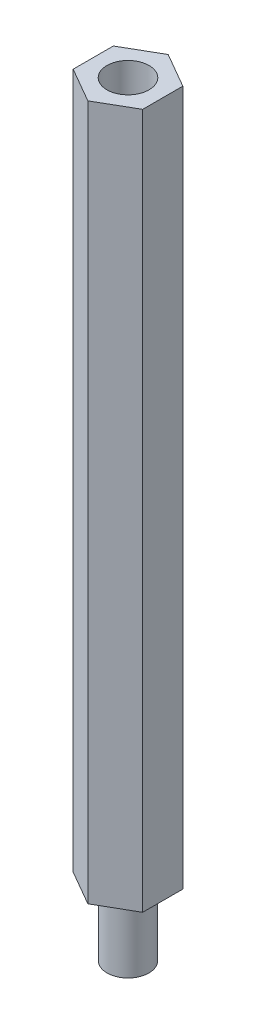
ISO-10303-21;
HEADER;
FILE_DESCRIPTION(('STEP AP214'),'2;1');
FILE_NAME('part.step','',(''),(''),'','','');
FILE_SCHEMA(('AUTOMOTIVE_DESIGN { 1 0 10303 214 1 1 1 1 }'));
ENDSEC;
DATA;
#1=APPLICATION_CONTEXT('core data for automotive mechanical design processes');
#2=APPLICATION_PROTOCOL_DEFINITION('international standard','automotive_design',2000,#1);
#3=PRODUCT_CONTEXT('',#1,'mechanical');
#4=PRODUCT('Part','Part','',(#3));
#5=PRODUCT_RELATED_PRODUCT_CATEGORY('part','',(#4));
#6=PRODUCT_DEFINITION_FORMATION('','',#4);
#7=PRODUCT_DEFINITION_CONTEXT('part definition',#1,'design');
#8=PRODUCT_DEFINITION('design','',#6,#7);
#9=PRODUCT_DEFINITION_SHAPE('','',#8);
#10=(LENGTH_UNIT() NAMED_UNIT(*) SI_UNIT(.MILLI.,.METRE.));
#11=(NAMED_UNIT(*) PLANE_ANGLE_UNIT() SI_UNIT($,.RADIAN.));
#12=(NAMED_UNIT(*) SI_UNIT($,.STERADIAN.) SOLID_ANGLE_UNIT());
#13=UNCERTAINTY_MEASURE_WITH_UNIT(LENGTH_MEASURE(1.E-05),#10,'distance_accuracy_value','');
#14=(GEOMETRIC_REPRESENTATION_CONTEXT(3) GLOBAL_UNCERTAINTY_ASSIGNED_CONTEXT((#13)) GLOBAL_UNIT_ASSIGNED_CONTEXT((#10,
#11,#12)) REPRESENTATION_CONTEXT('',''));
#15=CARTESIAN_POINT('',(0.,0.,0.));
#16=DIRECTION('',(0.,0.,1.));
#17=DIRECTION('',(1.,0.,0.));
#18=AXIS2_PLACEMENT_3D('',#15,#16,#17);
#19=CARTESIAN_POINT('',(-2.50000000000002,50.,1.44337567297408));
#20=DIRECTION('',(0.5,0.,-0.866025403784439));
#21=DIRECTION('',(-0.866025403784439,0.,-0.5));
#22=AXIS2_PLACEMENT_3D('',#19,#20,#21);
#23=PLANE('',#22);
#24=DIRECTION('',(0.866025403784439,0.,0.5));
#25=VECTOR('',#24,1.);
#26=CARTESIAN_POINT('',(-2.50000000000002,0.,1.44337567297408));
#27=LINE('',#26,#25);
#28=CARTESIAN_POINT('',(-2.50000000000002,0.,1.44337567297408));
#29=VERTEX_POINT('',#28);
#30=CARTESIAN_POINT('',(0.,0.,2.88675134594815));
#31=VERTEX_POINT('',#30);
#32=EDGE_CURVE('E122',#29,#31,#27,.T.);
#33=ORIENTED_EDGE('',*,*,#32,.T.);
#34=DIRECTION('',(0.,-1.,0.));
#35=VECTOR('',#34,1.);
#36=CARTESIAN_POINT('',(0.,50.,2.88675134594815));
#37=LINE('',#36,#35);
#38=CARTESIAN_POINT('',(0.,50.,2.88675134594815));
#39=VERTEX_POINT('',#38);
#40=EDGE_CURVE('E45',#39,#31,#37,.T.);
#41=ORIENTED_EDGE('',*,*,#40,.F.);
#42=DIRECTION('',(0.866025403784439,0.,0.5));
#43=VECTOR('',#42,1.);
#44=CARTESIAN_POINT('',(-2.50000000000002,50.,1.44337567297408));
#45=LINE('',#44,#43);
#46=CARTESIAN_POINT('',(-2.50000000000002,50.,1.44337567297408));
#47=VERTEX_POINT('',#46);
#48=EDGE_CURVE('E133',#47,#39,#45,.T.);
#49=ORIENTED_EDGE('',*,*,#48,.F.);
#50=DIRECTION('',(0.,-1.,0.));
#51=VECTOR('',#50,1.);
#52=CARTESIAN_POINT('',(-2.50000000000002,50.,1.44337567297408));
#53=LINE('',#52,#51);
#54=EDGE_CURVE('E118',#47,#29,#53,.T.);
#55=ORIENTED_EDGE('',*,*,#54,.T.);
#56=EDGE_LOOP('',(#33,#41,#49,#55));
#57=FACE_BOUND('',#56,.T.);
#58=ADVANCED_FACE('F37',(#57),#23,.F.);
#59=CARTESIAN_POINT('',(0.,50.,2.88675134594815));
#60=DIRECTION('',(-0.499999999999999,0.,-0.866025403784439));
#61=DIRECTION('',(-0.866025403784439,0.,0.499999999999999));
#62=AXIS2_PLACEMENT_3D('',#59,#60,#61);
#63=PLANE('',#62);
#64=DIRECTION('',(0.866025403784439,0.,-0.499999999999999));
#65=VECTOR('',#64,1.);
#66=CARTESIAN_POINT('',(0.,0.,2.88675134594815));
#67=LINE('',#66,#65);
#68=CARTESIAN_POINT('',(2.50000000000002,0.,1.44337567297408));
#69=VERTEX_POINT('',#68);
#70=EDGE_CURVE('E125',#31,#69,#67,.T.);
#71=ORIENTED_EDGE('',*,*,#70,.T.);
#72=DIRECTION('',(0.,-1.,0.));
#73=VECTOR('',#72,1.);
#74=CARTESIAN_POINT('',(2.50000000000002,50.,1.44337567297408));
#75=LINE('',#74,#73);
#76=CARTESIAN_POINT('',(2.50000000000002,50.,1.44337567297408));
#77=VERTEX_POINT('',#76);
#78=EDGE_CURVE('E137',#77,#69,#75,.T.);
#79=ORIENTED_EDGE('',*,*,#78,.F.);
#80=DIRECTION('',(0.866025403784439,0.,-0.499999999999999));
#81=VECTOR('',#80,1.);
#82=CARTESIAN_POINT('',(0.,50.,2.88675134594815));
#83=LINE('',#82,#81);
#84=EDGE_CURVE('E91',#39,#77,#83,.T.);
#85=ORIENTED_EDGE('',*,*,#84,.F.);
#86=ORIENTED_EDGE('',*,*,#40,.T.);
#87=EDGE_LOOP('',(#71,#79,#85,#86));
#88=FACE_BOUND('',#87,.T.);
#89=ADVANCED_FACE('F140',(#88),#63,.F.);
#90=CARTESIAN_POINT('',(2.50000000000002,50.,1.44337567297408));
#91=DIRECTION('',(-1.,0.,0.));
#92=DIRECTION('',(0.,0.,1.));
#93=AXIS2_PLACEMENT_3D('',#90,#91,#92);
#94=PLANE('',#93);
#95=DIRECTION('',(0.,0.,-1.));
#96=VECTOR('',#95,1.);
#97=CARTESIAN_POINT('',(2.50000000000002,0.,1.44337567297408));
#98=LINE('',#97,#96);
#99=CARTESIAN_POINT('',(2.50000000000002,0.,-1.44337567297408));
#100=VERTEX_POINT('',#99);
#101=EDGE_CURVE('E128',#69,#100,#98,.T.);
#102=ORIENTED_EDGE('',*,*,#101,.T.);
#103=DIRECTION('',(0.,-1.,0.));
#104=VECTOR('',#103,1.);
#105=CARTESIAN_POINT('',(2.50000000000002,50.,-1.44337567297408));
#106=LINE('',#105,#104);
#107=CARTESIAN_POINT('',(2.50000000000002,50.,-1.44337567297408));
#108=VERTEX_POINT('',#107);
#109=EDGE_CURVE('E113',#108,#100,#106,.T.);
#110=ORIENTED_EDGE('',*,*,#109,.F.);
#111=DIRECTION('',(0.,0.,-1.));
#112=VECTOR('',#111,1.);
#113=CARTESIAN_POINT('',(2.50000000000002,50.,1.44337567297408));
#114=LINE('',#113,#112);
#115=EDGE_CURVE('E104',#77,#108,#114,.T.);
#116=ORIENTED_EDGE('',*,*,#115,.F.);
#117=ORIENTED_EDGE('',*,*,#78,.T.);
#118=EDGE_LOOP('',(#102,#110,#116,#117));
#119=FACE_BOUND('',#118,.T.);
#120=ADVANCED_FACE('F148',(#119),#94,.F.);
#121=CARTESIAN_POINT('',(2.50000000000002,50.,-1.44337567297408));
#122=DIRECTION('',(-0.5,0.,0.866025403784439));
#123=DIRECTION('',(0.866025403784439,0.,0.5));
#124=AXIS2_PLACEMENT_3D('',#121,#122,#123);
#125=PLANE('',#124);
#126=DIRECTION('',(-0.866025403784439,0.,-0.5));
#127=VECTOR('',#126,1.);
#128=CARTESIAN_POINT('',(2.50000000000002,0.,-1.44337567297408));
#129=LINE('',#128,#127);
#130=CARTESIAN_POINT('',(0.,0.,-2.88675134594816));
#131=VERTEX_POINT('',#130);
#132=EDGE_CURVE('E112',#100,#131,#129,.T.);
#133=ORIENTED_EDGE('',*,*,#132,.T.);
#134=DIRECTION('',(0.,-1.,0.));
#135=VECTOR('',#134,1.);
#136=CARTESIAN_POINT('',(0.,50.,-2.88675134594816));
#137=LINE('',#136,#135);
#138=CARTESIAN_POINT('',(0.,50.,-2.88675134594816));
#139=VERTEX_POINT('',#138);
#140=EDGE_CURVE('E109',#139,#131,#137,.T.);
#141=ORIENTED_EDGE('',*,*,#140,.F.);
#142=DIRECTION('',(-0.866025403784439,0.,-0.5));
#143=VECTOR('',#142,1.);
#144=CARTESIAN_POINT('',(2.50000000000002,50.,-1.44337567297408));
#145=LINE('',#144,#143);
#146=EDGE_CURVE('E98',#108,#139,#145,.T.);
#147=ORIENTED_EDGE('',*,*,#146,.F.);
#148=ORIENTED_EDGE('',*,*,#109,.T.);
#149=EDGE_LOOP('',(#133,#141,#147,#148));
#150=FACE_BOUND('',#149,.T.);
#151=ADVANCED_FACE('F110',(#150),#125,.F.);
#152=CARTESIAN_POINT('',(0.,50.,-2.88675134594816));
#153=DIRECTION('',(0.5,0.,0.866025403784439));
#154=DIRECTION('',(0.866025403784439,0.,-0.5));
#155=AXIS2_PLACEMENT_3D('',#152,#153,#154);
#156=PLANE('',#155);
#157=DIRECTION('',(-0.866025403784439,0.,0.5));
#158=VECTOR('',#157,1.);
#159=CARTESIAN_POINT('',(0.,0.,-2.88675134594816));
#160=LINE('',#159,#158);
#161=CARTESIAN_POINT('',(-2.50000000000002,0.,-1.44337567297408));
#162=VERTEX_POINT('',#161);
#163=EDGE_CURVE('E76',#131,#162,#160,.T.);
#164=ORIENTED_EDGE('',*,*,#163,.T.);
#165=DIRECTION('',(0.,-1.,0.));
#166=VECTOR('',#165,1.);
#167=CARTESIAN_POINT('',(-2.50000000000002,50.,-1.44337567297408));
#168=LINE('',#167,#166);
#169=CARTESIAN_POINT('',(-2.50000000000002,50.,-1.44337567297408));
#170=VERTEX_POINT('',#169);
#171=EDGE_CURVE('E114',#170,#162,#168,.T.);
#172=ORIENTED_EDGE('',*,*,#171,.F.);
#173=DIRECTION('',(-0.866025403784439,0.,0.5));
#174=VECTOR('',#173,1.);
#175=CARTESIAN_POINT('',(0.,50.,-2.88675134594816));
#176=LINE('',#175,#174);
#177=EDGE_CURVE('E102',#139,#170,#176,.T.);
#178=ORIENTED_EDGE('',*,*,#177,.F.);
#179=ORIENTED_EDGE('',*,*,#140,.T.);
#180=EDGE_LOOP('',(#164,#172,#178,#179));
#181=FACE_BOUND('',#180,.T.);
#182=ADVANCED_FACE('F116',(#181),#156,.F.);
#183=CARTESIAN_POINT('',(-2.50000000000002,50.,-1.44337567297408));
#184=DIRECTION('',(1.,0.,0.));
#185=DIRECTION('',(0.,0.,-1.));
#186=AXIS2_PLACEMENT_3D('',#183,#184,#185);
#187=PLANE('',#186);
#188=DIRECTION('',(0.,0.,1.));
#189=VECTOR('',#188,1.);
#190=CARTESIAN_POINT('',(-2.50000000000002,0.,-1.44337567297408));
#191=LINE('',#190,#189);
#192=EDGE_CURVE('E82',#162,#29,#191,.T.);
#193=ORIENTED_EDGE('',*,*,#192,.T.);
#194=ORIENTED_EDGE('',*,*,#54,.F.);
#195=DIRECTION('',(0.,0.,1.));
#196=VECTOR('',#195,1.);
#197=CARTESIAN_POINT('',(-2.50000000000002,50.,-1.44337567297408));
#198=LINE('',#197,#196);
#199=EDGE_CURVE('E53',#170,#47,#198,.T.);
#200=ORIENTED_EDGE('',*,*,#199,.F.);
#201=ORIENTED_EDGE('',*,*,#171,.T.);
#202=EDGE_LOOP('',(#193,#194,#200,#201));
#203=FACE_BOUND('',#202,.T.);
#204=ADVANCED_FACE('F179',(#203),#187,.F.);
#205=CARTESIAN_POINT('',(0.,50.,0.));
#206=DIRECTION('',(0.,1.,0.));
#207=DIRECTION('',(0.,0.,1.));
#208=AXIS2_PLACEMENT_3D('',#205,#206,#207);
#209=PLANE('',#208);
#210=CARTESIAN_POINT('',(0.,50.,0.));
#211=DIRECTION('',(0.,1.,0.));
#212=DIRECTION('',(0.,0.,1.));
#213=AXIS2_PLACEMENT_3D('',#210,#211,#212);
#214=CIRCLE('',#213,1.51610249304691);
#215=CARTESIAN_POINT('',(0.,50.,1.51610249304691));
#216=VERTEX_POINT('',#215);
#217=EDGE_CURVE('E152',#216,#216,#214,.T.);
#218=ORIENTED_EDGE('',*,*,#217,.F.);
#219=EDGE_LOOP('',(#218));
#220=FACE_BOUND('',#219,.T.);
#221=ORIENTED_EDGE('',*,*,#48,.T.);
#222=ORIENTED_EDGE('',*,*,#84,.T.);
#223=ORIENTED_EDGE('',*,*,#115,.T.);
#224=ORIENTED_EDGE('',*,*,#146,.T.);
#225=ORIENTED_EDGE('',*,*,#177,.T.);
#226=ORIENTED_EDGE('',*,*,#199,.T.);
#227=EDGE_LOOP('',(#221,#222,#223,#224,#225,#226));
#228=FACE_BOUND('',#227,.T.);
#229=ADVANCED_FACE('F100',(#220,#228),#209,.T.);
#230=CARTESIAN_POINT('',(0.,0.,0.));
#231=DIRECTION('',(0.,1.,0.));
#232=DIRECTION('',(0.,0.,1.));
#233=AXIS2_PLACEMENT_3D('',#230,#231,#232);
#234=PLANE('',#233);
#235=CARTESIAN_POINT('',(0.,0.,0.));
#236=DIRECTION('',(0.,1.,0.));
#237=DIRECTION('',(0.,0.,1.));
#238=AXIS2_PLACEMENT_3D('',#235,#236,#237);
#239=CIRCLE('',#238,1.50585590252469);
#240=CARTESIAN_POINT('',(0.,0.,1.50585590252469));
#241=VERTEX_POINT('',#240);
#242=EDGE_CURVE('E11',#241,#241,#239,.F.);
#243=ORIENTED_EDGE('',*,*,#242,.F.);
#244=EDGE_LOOP('',(#243));
#245=FACE_BOUND('',#244,.T.);
#246=ORIENTED_EDGE('',*,*,#32,.F.);
#247=ORIENTED_EDGE('',*,*,#192,.F.);
#248=ORIENTED_EDGE('',*,*,#163,.F.);
#249=ORIENTED_EDGE('',*,*,#132,.F.);
#250=ORIENTED_EDGE('',*,*,#101,.F.);
#251=ORIENTED_EDGE('',*,*,#70,.F.);
#252=EDGE_LOOP('',(#246,#247,#248,#249,#250,#251));
#253=FACE_BOUND('',#252,.T.);
#254=ADVANCED_FACE('F145',(#245,#253),#234,.F.);
#255=CARTESIAN_POINT('',(0.,40.,0.));
#256=DIRECTION('',(0.,1.,0.));
#257=DIRECTION('',(0.,0.,1.));
#258=AXIS2_PLACEMENT_3D('',#255,#256,#257);
#259=CYLINDRICAL_SURFACE('',#258,1.51610249304691);
#260=CARTESIAN_POINT('',(0.,40.,0.));
#261=DIRECTION('',(0.,1.,0.));
#262=DIRECTION('',(0.,0.,1.));
#263=AXIS2_PLACEMENT_3D('',#260,#261,#262);
#264=CIRCLE('',#263,1.51610249304691);
#265=CARTESIAN_POINT('',(0.,40.,1.51610249304691));
#266=VERTEX_POINT('',#265);
#267=EDGE_CURVE('E126',#266,#266,#264,.T.);
#268=ORIENTED_EDGE('',*,*,#267,.F.);
#269=EDGE_LOOP('',(#268));
#270=FACE_BOUND('',#269,.T.);
#271=ORIENTED_EDGE('',*,*,#217,.T.);
#272=EDGE_LOOP('',(#271));
#273=FACE_BOUND('',#272,.T.);
#274=ADVANCED_FACE('F171',(#270,#273),#259,.F.);
#275=CARTESIAN_POINT('',(0.,40.,0.));
#276=DIRECTION('',(0.,1.,0.));
#277=DIRECTION('',(0.,0.,1.));
#278=AXIS2_PLACEMENT_3D('',#275,#276,#277);
#279=PLANE('',#278);
#280=ORIENTED_EDGE('',*,*,#267,.T.);
#281=EDGE_LOOP('',(#280));
#282=FACE_BOUND('',#281,.T.);
#283=ADVANCED_FACE('F166',(#282),#279,.T.);
#284=CARTESIAN_POINT('',(0.,-5.,0.));
#285=DIRECTION('',(0.,1.,0.));
#286=DIRECTION('',(0.,0.,1.));
#287=AXIS2_PLACEMENT_3D('',#284,#285,#286);
#288=CYLINDRICAL_SURFACE('',#287,1.50585590252469);
#289=CARTESIAN_POINT('',(0.,-5.,0.));
#290=DIRECTION('',(0.,-1.,0.));
#291=DIRECTION('',(0.,0.,-1.));
#292=AXIS2_PLACEMENT_3D('',#289,#290,#291);
#293=CIRCLE('',#292,1.50585590252469);
#294=CARTESIAN_POINT('',(0.,-5.,-1.50585590252469));
#295=VERTEX_POINT('',#294);
#296=EDGE_CURVE('E155',#295,#295,#293,.T.);
#297=ORIENTED_EDGE('',*,*,#296,.F.);
#298=EDGE_LOOP('',(#297));
#299=FACE_BOUND('',#298,.T.);
#300=ORIENTED_EDGE('',*,*,#242,.T.);
#301=EDGE_LOOP('',(#300));
#302=FACE_BOUND('',#301,.T.);
#303=ADVANCED_FACE('F163',(#299,#302),#288,.T.);
#304=CARTESIAN_POINT('',(0.,-5.,0.));
#305=DIRECTION('',(0.,-1.,0.));
#306=DIRECTION('',(0.,0.,-1.));
#307=AXIS2_PLACEMENT_3D('',#304,#305,#306);
#308=PLANE('',#307);
#309=ORIENTED_EDGE('',*,*,#296,.T.);
#310=EDGE_LOOP('',(#309));
#311=FACE_BOUND('',#310,.T.);
#312=ADVANCED_FACE('F161',(#311),#308,.T.);
#313=CLOSED_SHELL('',(#58,#89,#120,#151,#182,#204,#229,#254,#274,#283,#303,#312));
#314=MANIFOLD_SOLID_BREP('B2',#313);
#315=ADVANCED_BREP_SHAPE_REPRESENTATION('',(#18,#314),#14);
#316=SHAPE_DEFINITION_REPRESENTATION(#9,#315);
ENDSEC;
END-ISO-10303-21;
